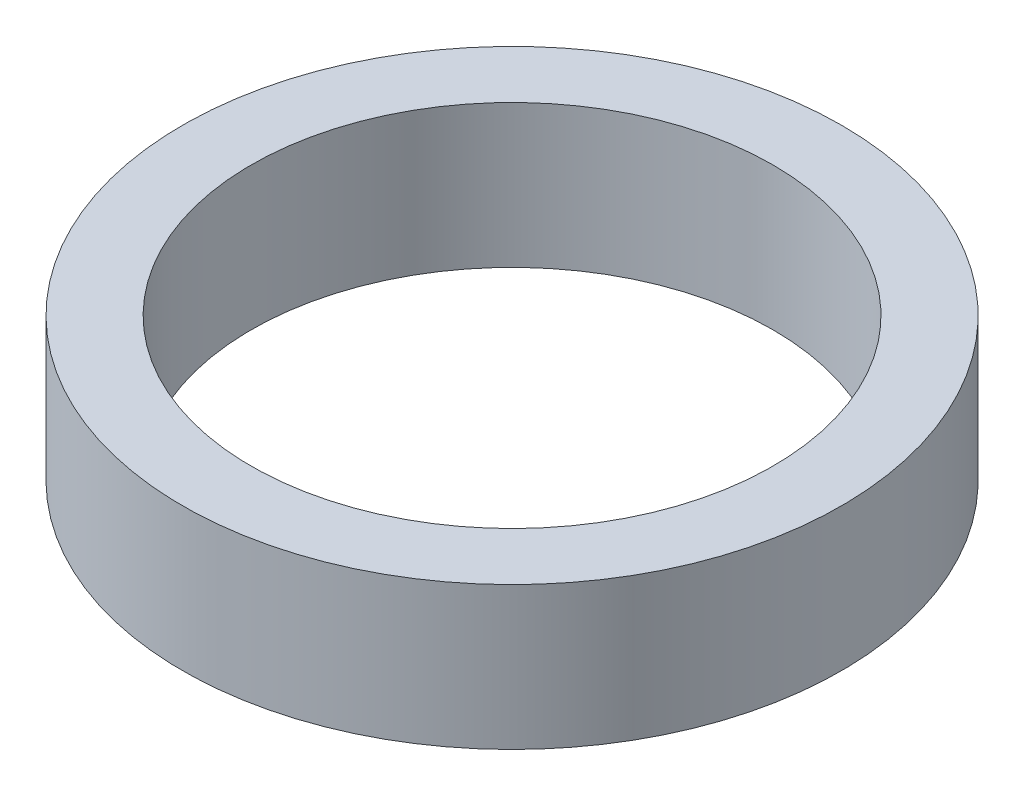
ISO-10303-21;
HEADER;
FILE_DESCRIPTION(('STEP AP214'),'2;1');
FILE_NAME('part.step','',(''),(''),'','','');
FILE_SCHEMA(('AUTOMOTIVE_DESIGN { 1 0 10303 214 1 1 1 1 }'));
ENDSEC;
DATA;
#1=APPLICATION_CONTEXT('core data for automotive mechanical design processes');
#2=APPLICATION_PROTOCOL_DEFINITION('international standard','automotive_design',2000,#1);
#3=PRODUCT_CONTEXT('',#1,'mechanical');
#4=PRODUCT('Part','Part','',(#3));
#5=PRODUCT_RELATED_PRODUCT_CATEGORY('part','',(#4));
#6=PRODUCT_DEFINITION_FORMATION('','',#4);
#7=PRODUCT_DEFINITION_CONTEXT('part definition',#1,'design');
#8=PRODUCT_DEFINITION('design','',#6,#7);
#9=PRODUCT_DEFINITION_SHAPE('','',#8);
#10=(LENGTH_UNIT() NAMED_UNIT(*) SI_UNIT(.MILLI.,.METRE.));
#11=(NAMED_UNIT(*) PLANE_ANGLE_UNIT() SI_UNIT($,.RADIAN.));
#12=(NAMED_UNIT(*) SI_UNIT($,.STERADIAN.) SOLID_ANGLE_UNIT());
#13=UNCERTAINTY_MEASURE_WITH_UNIT(LENGTH_MEASURE(1.E-05),#10,'distance_accuracy_value','');
#14=(GEOMETRIC_REPRESENTATION_CONTEXT(3) GLOBAL_UNCERTAINTY_ASSIGNED_CONTEXT((#13)) GLOBAL_UNIT_ASSIGNED_CONTEXT((#10,
#11,#12)) REPRESENTATION_CONTEXT('',''));
#15=CARTESIAN_POINT('',(0.,0.,0.));
#16=DIRECTION('',(0.,0.,1.));
#17=DIRECTION('',(1.,0.,0.));
#18=AXIS2_PLACEMENT_3D('',#15,#16,#17);
#19=CARTESIAN_POINT('',(0.,26.,0.));
#20=DIRECTION('',(0.,-1.,0.));
#21=DIRECTION('',(0.,0.,-1.));
#22=AXIS2_PLACEMENT_3D('',#19,#20,#21);
#23=CYLINDRICAL_SURFACE('',#22,60.);
#24=CARTESIAN_POINT('',(0.,26.,0.));
#25=DIRECTION('',(0.,1.,0.));
#26=DIRECTION('',(0.,0.,1.));
#27=AXIS2_PLACEMENT_3D('',#24,#25,#26);
#28=CIRCLE('',#27,60.);
#29=CARTESIAN_POINT('',(0.,26.,-60.));
#30=VERTEX_POINT('',#29);
#31=EDGE_CURVE('E10',#30,#30,#28,.T.);
#32=CARTESIAN_POINT('',(0.,0.,0.));
#33=DIRECTION('',(0.,1.,0.));
#34=DIRECTION('',(0.,0.,1.));
#35=AXIS2_PLACEMENT_3D('',#32,#33,#34);
#36=CIRCLE('',#35,60.);
#37=CARTESIAN_POINT('',(0.,0.,-60.));
#38=VERTEX_POINT('',#37);
#39=EDGE_CURVE('E37',#38,#38,#36,.T.);
#40=CARTESIAN_POINT('',(0.,26.,-60.));
#41=CARTESIAN_POINT('',(0.,25.7291666666667,-60.));
#42=CARTESIAN_POINT('',(0.,25.4583333333333,-60.));
#43=CARTESIAN_POINT('',(0.,24.9166666666667,-60.));
#44=CARTESIAN_POINT('',(0.,24.6458333333333,-60.));
#45=CARTESIAN_POINT('',(0.,24.1041666666667,-60.));
#46=CARTESIAN_POINT('',(0.,23.8333333333333,-60.));
#47=CARTESIAN_POINT('',(0.,23.2916666666667,-60.));
#48=CARTESIAN_POINT('',(0.,23.0208333333333,-60.));
#49=CARTESIAN_POINT('',(0.,22.4791666666667,-60.));
#50=CARTESIAN_POINT('',(0.,22.2083333333333,-60.));
#51=CARTESIAN_POINT('',(0.,21.6666666666667,-60.));
#52=CARTESIAN_POINT('',(0.,21.3958333333333,-60.));
#53=CARTESIAN_POINT('',(0.,20.8541666666667,-60.));
#54=CARTESIAN_POINT('',(0.,20.5833333333333,-60.));
#55=CARTESIAN_POINT('',(0.,20.0416666666667,-60.));
#56=CARTESIAN_POINT('',(0.,19.7708333333333,-60.));
#57=CARTESIAN_POINT('',(0.,19.2291666666667,-60.));
#58=CARTESIAN_POINT('',(0.,18.9583333333333,-60.));
#59=CARTESIAN_POINT('',(0.,18.4166666666667,-60.));
#60=CARTESIAN_POINT('',(0.,18.1458333333333,-60.));
#61=CARTESIAN_POINT('',(0.,17.6041666666667,-60.));
#62=CARTESIAN_POINT('',(0.,17.3333333333333,-60.));
#63=CARTESIAN_POINT('',(0.,16.7916666666667,-60.));
#64=CARTESIAN_POINT('',(0.,16.5208333333333,-60.));
#65=CARTESIAN_POINT('',(0.,15.9791666666667,-60.));
#66=CARTESIAN_POINT('',(0.,15.7083333333333,-60.));
#67=CARTESIAN_POINT('',(0.,15.1666666666667,-60.));
#68=CARTESIAN_POINT('',(0.,14.8958333333333,-60.));
#69=CARTESIAN_POINT('',(0.,14.3541666666667,-60.));
#70=CARTESIAN_POINT('',(0.,14.0833333333333,-60.));
#71=CARTESIAN_POINT('',(0.,13.5416666666667,-60.));
#72=CARTESIAN_POINT('',(0.,13.2708333333333,-60.));
#73=CARTESIAN_POINT('',(0.,12.7291666666667,-60.));
#74=CARTESIAN_POINT('',(0.,12.4583333333333,-60.));
#75=CARTESIAN_POINT('',(0.,11.9166666666667,-60.));
#76=CARTESIAN_POINT('',(0.,11.6458333333333,-60.));
#77=CARTESIAN_POINT('',(0.,11.1041666666667,-60.));
#78=CARTESIAN_POINT('',(0.,10.8333333333333,-60.));
#79=CARTESIAN_POINT('',(0.,10.2916666666667,-60.));
#80=CARTESIAN_POINT('',(0.,10.0208333333333,-60.));
#81=CARTESIAN_POINT('',(0.,9.47916666666667,-60.));
#82=CARTESIAN_POINT('',(0.,9.20833333333333,-60.));
#83=CARTESIAN_POINT('',(0.,8.66666666666667,-60.));
#84=CARTESIAN_POINT('',(0.,8.39583333333333,-60.));
#85=CARTESIAN_POINT('',(0.,7.85416666666667,-60.));
#86=CARTESIAN_POINT('',(0.,7.58333333333333,-60.));
#87=CARTESIAN_POINT('',(0.,7.04166666666667,-60.));
#88=CARTESIAN_POINT('',(0.,6.77083333333333,-60.));
#89=CARTESIAN_POINT('',(0.,6.22916666666667,-60.));
#90=CARTESIAN_POINT('',(0.,5.95833333333333,-60.));
#91=CARTESIAN_POINT('',(0.,5.41666666666667,-60.));
#92=CARTESIAN_POINT('',(0.,5.14583333333333,-60.));
#93=CARTESIAN_POINT('',(0.,4.60416666666667,-60.));
#94=CARTESIAN_POINT('',(0.,4.33333333333333,-60.));
#95=CARTESIAN_POINT('',(0.,3.79166666666667,-60.));
#96=CARTESIAN_POINT('',(0.,3.52083333333333,-60.));
#97=CARTESIAN_POINT('',(0.,2.97916666666667,-60.));
#98=CARTESIAN_POINT('',(0.,2.70833333333333,-60.));
#99=CARTESIAN_POINT('',(0.,2.16666666666667,-60.));
#100=CARTESIAN_POINT('',(0.,1.89583333333333,-60.));
#101=CARTESIAN_POINT('',(0.,1.35416666666667,-60.));
#102=CARTESIAN_POINT('',(0.,1.08333333333333,-60.));
#103=CARTESIAN_POINT('',(0.,0.541666666666667,-60.));
#104=CARTESIAN_POINT('',(0.,0.270833333333334,-60.));
#105=CARTESIAN_POINT('',(0.,0.,-60.));
#106=B_SPLINE_CURVE_WITH_KNOTS('',3,(#40,#41,#42,#43,#44,#45,#46,#47,#48,#49,#50,#51,#52,#53,
#54,#55,#56,#57,#58,#59,#60,#61,#62,#63,#64,#65,#66,#67,#68,#69,#70,#71,#72,#73,#74,#75,#76,#77,
#78,#79,#80,#81,#82,#83,#84,#85,#86,#87,#88,#89,#90,#91,#92,#93,#94,#95,#96,#97,#98,#99,#100,
#101,#102,#103,#104,#105),.UNSPECIFIED.,.F.,.F.,(4,2,2,2,2,2,2,2,2,2,2,2,2,2,2,2,2,2,2,2,2,2,2,
2,2,2,2,2,2,2,2,2,4),(0.,0.812499999999997,1.625,2.4375,3.25,4.0625,4.875,5.6875,6.5,7.3125,
8.125,8.93749999999999,9.74999999999999,10.5625,11.375,12.1875,13.,13.8125,14.625,15.4375,16.25,
17.0625,17.875,18.6875,19.5,20.3125,21.125,21.9375,22.75,23.5625,24.375,25.1875,26.),.UNSPECIFIED.);
#107=EDGE_CURVE('BSEAM40',#30,#38,#106,.T.);
#108=ORIENTED_EDGE('',*,*,#31,.F.);
#109=ORIENTED_EDGE('',*,*,#39,.T.);
#110=ORIENTED_EDGE('',*,*,#107,.T.);
#111=ORIENTED_EDGE('',*,*,#107,.F.);
#112=EDGE_LOOP('',(#108,#110,#109,#111));
#113=FACE_BOUND('',#112,.T.);
#114=ADVANCED_FACE('F40',(#113),#23,.T.);
#115=CARTESIAN_POINT('',(0.,26.,0.));
#116=DIRECTION('',(0.,1.,0.));
#117=DIRECTION('',(0.,0.,1.));
#118=AXIS2_PLACEMENT_3D('',#115,#116,#117);
#119=PLANE('',#118);
#120=CARTESIAN_POINT('',(0.,26.,0.));
#121=DIRECTION('',(0.,1.,0.));
#122=DIRECTION('',(0.,0.,1.));
#123=AXIS2_PLACEMENT_3D('',#120,#121,#122);
#124=CIRCLE('',#123,47.5);
#125=CARTESIAN_POINT('',(0.,26.,-47.5));
#126=VERTEX_POINT('',#125);
#127=EDGE_CURVE('E50',#126,#126,#124,.T.);
#128=ORIENTED_EDGE('',*,*,#127,.F.);
#129=EDGE_LOOP('',(#128));
#130=FACE_BOUND('',#129,.T.);
#131=ORIENTED_EDGE('',*,*,#31,.T.);
#132=EDGE_LOOP('',(#131));
#133=FACE_BOUND('',#132,.T.);
#134=ADVANCED_FACE('F59',(#130,#133),#119,.T.);
#135=CARTESIAN_POINT('',(0.,0.,0.));
#136=DIRECTION('',(0.,1.,0.));
#137=DIRECTION('',(0.,0.,1.));
#138=AXIS2_PLACEMENT_3D('',#135,#136,#137);
#139=PLANE('',#138);
#140=CARTESIAN_POINT('',(0.,0.,0.));
#141=DIRECTION('',(0.,1.,0.));
#142=DIRECTION('',(0.,0.,1.));
#143=AXIS2_PLACEMENT_3D('',#140,#141,#142);
#144=CIRCLE('',#143,47.5);
#145=CARTESIAN_POINT('',(0.,0.,-47.5));
#146=VERTEX_POINT('',#145);
#147=EDGE_CURVE('E47',#146,#146,#144,.T.);
#148=ORIENTED_EDGE('',*,*,#147,.T.);
#149=EDGE_LOOP('',(#148));
#150=FACE_BOUND('',#149,.T.);
#151=ORIENTED_EDGE('',*,*,#39,.F.);
#152=EDGE_LOOP('',(#151));
#153=FACE_BOUND('',#152,.T.);
#154=ADVANCED_FACE('F58',(#150,#153),#139,.F.);
#155=CARTESIAN_POINT('',(0.,26.,0.));
#156=DIRECTION('',(0.,-1.,0.));
#157=DIRECTION('',(0.,0.,-1.));
#158=AXIS2_PLACEMENT_3D('',#155,#156,#157);
#159=CYLINDRICAL_SURFACE('',#158,47.5);
#160=CARTESIAN_POINT('',(0.,26.,-47.5));
#161=CARTESIAN_POINT('',(0.,25.7291666666667,-47.5));
#162=CARTESIAN_POINT('',(0.,25.4583333333333,-47.5));
#163=CARTESIAN_POINT('',(0.,24.9166666666667,-47.5));
#164=CARTESIAN_POINT('',(0.,24.6458333333333,-47.5));
#165=CARTESIAN_POINT('',(0.,24.1041666666667,-47.5));
#166=CARTESIAN_POINT('',(0.,23.8333333333333,-47.5));
#167=CARTESIAN_POINT('',(0.,23.2916666666667,-47.5));
#168=CARTESIAN_POINT('',(0.,23.0208333333333,-47.5));
#169=CARTESIAN_POINT('',(0.,22.4791666666667,-47.5));
#170=CARTESIAN_POINT('',(0.,22.2083333333333,-47.5));
#171=CARTESIAN_POINT('',(0.,21.6666666666667,-47.5));
#172=CARTESIAN_POINT('',(0.,21.3958333333333,-47.5));
#173=CARTESIAN_POINT('',(0.,20.8541666666667,-47.5));
#174=CARTESIAN_POINT('',(0.,20.5833333333333,-47.5));
#175=CARTESIAN_POINT('',(0.,20.0416666666667,-47.5));
#176=CARTESIAN_POINT('',(0.,19.7708333333333,-47.5));
#177=CARTESIAN_POINT('',(0.,19.2291666666667,-47.5));
#178=CARTESIAN_POINT('',(0.,18.9583333333333,-47.5));
#179=CARTESIAN_POINT('',(0.,18.4166666666667,-47.5));
#180=CARTESIAN_POINT('',(0.,18.1458333333333,-47.5));
#181=CARTESIAN_POINT('',(0.,17.6041666666667,-47.5));
#182=CARTESIAN_POINT('',(0.,17.3333333333333,-47.5));
#183=CARTESIAN_POINT('',(0.,16.7916666666667,-47.5));
#184=CARTESIAN_POINT('',(0.,16.5208333333333,-47.5));
#185=CARTESIAN_POINT('',(0.,15.9791666666667,-47.5));
#186=CARTESIAN_POINT('',(0.,15.7083333333333,-47.5));
#187=CARTESIAN_POINT('',(0.,15.1666666666667,-47.5));
#188=CARTESIAN_POINT('',(0.,14.8958333333333,-47.5));
#189=CARTESIAN_POINT('',(0.,14.3541666666667,-47.5));
#190=CARTESIAN_POINT('',(0.,14.0833333333333,-47.5));
#191=CARTESIAN_POINT('',(0.,13.5416666666667,-47.5));
#192=CARTESIAN_POINT('',(0.,13.2708333333333,-47.5));
#193=CARTESIAN_POINT('',(0.,12.7291666666667,-47.5));
#194=CARTESIAN_POINT('',(0.,12.4583333333333,-47.5));
#195=CARTESIAN_POINT('',(0.,11.9166666666667,-47.5));
#196=CARTESIAN_POINT('',(0.,11.6458333333333,-47.5));
#197=CARTESIAN_POINT('',(0.,11.1041666666667,-47.5));
#198=CARTESIAN_POINT('',(0.,10.8333333333333,-47.5));
#199=CARTESIAN_POINT('',(0.,10.2916666666667,-47.5));
#200=CARTESIAN_POINT('',(0.,10.0208333333333,-47.5));
#201=CARTESIAN_POINT('',(0.,9.47916666666667,-47.5));
#202=CARTESIAN_POINT('',(0.,9.20833333333333,-47.5));
#203=CARTESIAN_POINT('',(0.,8.66666666666667,-47.5));
#204=CARTESIAN_POINT('',(0.,8.39583333333333,-47.5));
#205=CARTESIAN_POINT('',(0.,7.85416666666667,-47.5));
#206=CARTESIAN_POINT('',(0.,7.58333333333333,-47.5));
#207=CARTESIAN_POINT('',(0.,7.04166666666667,-47.5));
#208=CARTESIAN_POINT('',(0.,6.77083333333333,-47.5));
#209=CARTESIAN_POINT('',(0.,6.22916666666667,-47.5));
#210=CARTESIAN_POINT('',(0.,5.95833333333333,-47.5));
#211=CARTESIAN_POINT('',(0.,5.41666666666667,-47.5));
#212=CARTESIAN_POINT('',(0.,5.14583333333333,-47.5));
#213=CARTESIAN_POINT('',(0.,4.60416666666667,-47.5));
#214=CARTESIAN_POINT('',(0.,4.33333333333333,-47.5));
#215=CARTESIAN_POINT('',(0.,3.79166666666667,-47.5));
#216=CARTESIAN_POINT('',(0.,3.52083333333333,-47.5));
#217=CARTESIAN_POINT('',(0.,2.97916666666667,-47.5));
#218=CARTESIAN_POINT('',(0.,2.70833333333333,-47.5));
#219=CARTESIAN_POINT('',(0.,2.16666666666667,-47.5));
#220=CARTESIAN_POINT('',(0.,1.89583333333333,-47.5));
#221=CARTESIAN_POINT('',(0.,1.35416666666667,-47.5));
#222=CARTESIAN_POINT('',(0.,1.08333333333333,-47.5));
#223=CARTESIAN_POINT('',(0.,0.541666666666667,-47.5));
#224=CARTESIAN_POINT('',(0.,0.270833333333334,-47.5));
#225=CARTESIAN_POINT('',(0.,0.,-47.5));
#226=B_SPLINE_CURVE_WITH_KNOTS('',3,(#160,#161,#162,#163,#164,#165,#166,#167,#168,#169,#170,
#171,#172,#173,#174,#175,#176,#177,#178,#179,#180,#181,#182,#183,#184,#185,#186,#187,#188,#189,
#190,#191,#192,#193,#194,#195,#196,#197,#198,#199,#200,#201,#202,#203,#204,#205,#206,#207,#208,
#209,#210,#211,#212,#213,#214,#215,#216,#217,#218,#219,#220,#221,#222,#223,#224,#225),
.UNSPECIFIED.,.F.,.F.,(4,2,2,2,2,2,2,2,2,2,2,2,2,2,2,2,2,2,2,2,2,2,2,2,2,2,2,2,2,2,2,2,4),(0.,
0.812500000000001,1.625,2.4375,3.25,4.0625,4.875,5.6875,6.5,7.3125,8.125,8.9375,9.75,10.5625,
11.375,12.1875,13.,13.8125,14.625,15.4375,16.25,17.0625,17.875,18.6875,19.5,20.3125,21.125,
21.9375,22.75,23.5625,24.375,25.1875,26.),.UNSPECIFIED.);
#227=EDGE_CURVE('BSEAM54',#126,#146,#226,.T.);
#228=ORIENTED_EDGE('',*,*,#127,.T.);
#229=ORIENTED_EDGE('',*,*,#147,.F.);
#230=ORIENTED_EDGE('',*,*,#227,.T.);
#231=ORIENTED_EDGE('',*,*,#227,.F.);
#232=EDGE_LOOP('',(#228,#230,#229,#231));
#233=FACE_BOUND('',#232,.T.);
#234=ADVANCED_FACE('F54',(#233),#159,.F.);
#235=CLOSED_SHELL('',(#114,#134,#154,#234));
#236=MANIFOLD_SOLID_BREP('B2',#235);
#237=ADVANCED_BREP_SHAPE_REPRESENTATION('',(#18,#236),#14);
#238=SHAPE_DEFINITION_REPRESENTATION(#9,#237);
ENDSEC;
END-ISO-10303-21;
